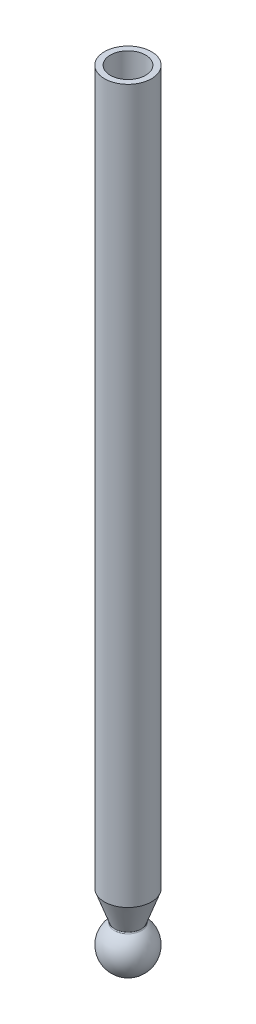
ISO-10303-21;
HEADER;
FILE_DESCRIPTION(('STEP AP214'),'2;1');
FILE_NAME('part.step','',(''),(''),'','','');
FILE_SCHEMA(('AUTOMOTIVE_DESIGN { 1 0 10303 214 1 1 1 1 }'));
ENDSEC;
DATA;
#1=APPLICATION_CONTEXT('core data for automotive mechanical design processes');
#2=APPLICATION_PROTOCOL_DEFINITION('international standard','automotive_design',2000,#1);
#3=PRODUCT_CONTEXT('',#1,'mechanical');
#4=PRODUCT('Part','Part','',(#3));
#5=PRODUCT_RELATED_PRODUCT_CATEGORY('part','',(#4));
#6=PRODUCT_DEFINITION_FORMATION('','',#4);
#7=PRODUCT_DEFINITION_CONTEXT('part definition',#1,'design');
#8=PRODUCT_DEFINITION('design','',#6,#7);
#9=PRODUCT_DEFINITION_SHAPE('','',#8);
#10=(LENGTH_UNIT() NAMED_UNIT(*) SI_UNIT(.MILLI.,.METRE.));
#11=(NAMED_UNIT(*) PLANE_ANGLE_UNIT() SI_UNIT($,.RADIAN.));
#12=(NAMED_UNIT(*) SI_UNIT($,.STERADIAN.) SOLID_ANGLE_UNIT());
#13=UNCERTAINTY_MEASURE_WITH_UNIT(LENGTH_MEASURE(1.E-05),#10,'distance_accuracy_value','');
#14=(GEOMETRIC_REPRESENTATION_CONTEXT(3) GLOBAL_UNCERTAINTY_ASSIGNED_CONTEXT((#13)) GLOBAL_UNIT_ASSIGNED_CONTEXT((#10,
#11,#12)) REPRESENTATION_CONTEXT('',''));
#15=CARTESIAN_POINT('',(0.,0.,0.));
#16=DIRECTION('',(0.,0.,1.));
#17=DIRECTION('',(1.,0.,0.));
#18=AXIS2_PLACEMENT_3D('',#15,#16,#17);
#19=CARTESIAN_POINT('',(0.,-1200.,0.));
#20=DIRECTION('',(0.,1.,0.));
#21=DIRECTION('',(0.,0.,1.));
#22=AXIS2_PLACEMENT_3D('',#19,#20,#21);
#23=CYLINDRICAL_SURFACE('',#22,40.);
#24=CARTESIAN_POINT('',(0.,0.,0.));
#25=DIRECTION('',(0.,1.,0.));
#26=DIRECTION('',(0.,0.,1.));
#27=AXIS2_PLACEMENT_3D('',#24,#25,#26);
#28=CIRCLE('',#27,40.);
#29=CARTESIAN_POINT('',(0.,0.,40.));
#30=VERTEX_POINT('',#29);
#31=EDGE_CURVE('E10',#30,#30,#28,.T.);
#32=ORIENTED_EDGE('',*,*,#31,.F.);
#33=EDGE_LOOP('',(#32));
#34=FACE_BOUND('',#33,.T.);
#35=CARTESIAN_POINT('',(0.,-1214.39999166075,0.));
#36=DIRECTION('',(0.,-1.,0.));
#37=DIRECTION('',(0.745631560094061,0.,-0.666358444526439));
#38=AXIS2_PLACEMENT_3D('',#35,#36,#37);
#39=CIRCLE('',#38,39.9999982021314);
#40=CARTESIAN_POINT('',(-29.8252610632149,-1214.39999166075,26.6543365830327));
#41=VERTEX_POINT('',#40);
#42=EDGE_CURVE('E66',#41,#41,#39,.T.);
#43=ORIENTED_EDGE('',*,*,#42,.F.);
#44=EDGE_LOOP('',(#43));
#45=FACE_BOUND('',#44,.T.);
#46=ADVANCED_FACE('F39',(#34,#45),#23,.T.);
#47=CARTESIAN_POINT('',(0.,0.,0.));
#48=DIRECTION('',(0.,1.,0.));
#49=DIRECTION('',(0.,0.,1.));
#50=AXIS2_PLACEMENT_3D('',#47,#48,#49);
#51=PLANE('',#50);
#52=CARTESIAN_POINT('',(0.,0.,0.));
#53=DIRECTION('',(0.,1.,0.));
#54=DIRECTION('',(0.,0.,1.));
#55=AXIS2_PLACEMENT_3D('',#52,#53,#54);
#56=CIRCLE('',#55,30.);
#57=CARTESIAN_POINT('',(0.,0.,30.));
#58=VERTEX_POINT('',#57);
#59=EDGE_CURVE('E52',#58,#58,#56,.T.);
#60=ORIENTED_EDGE('',*,*,#59,.F.);
#61=EDGE_LOOP('',(#60));
#62=FACE_BOUND('',#61,.T.);
#63=ORIENTED_EDGE('',*,*,#31,.T.);
#64=EDGE_LOOP('',(#63));
#65=FACE_BOUND('',#64,.T.);
#66=ADVANCED_FACE('F74',(#62,#65),#51,.T.);
#67=CARTESIAN_POINT('',(0.,-800.,0.));
#68=DIRECTION('',(0.,1.,0.));
#69=DIRECTION('',(0.,0.,1.));
#70=AXIS2_PLACEMENT_3D('',#67,#68,#69);
#71=CYLINDRICAL_SURFACE('',#70,30.);
#72=CARTESIAN_POINT('',(0.,-800.,0.));
#73=DIRECTION('',(0.,1.,0.));
#74=DIRECTION('',(0.,0.,1.));
#75=AXIS2_PLACEMENT_3D('',#72,#73,#74);
#76=CIRCLE('',#75,30.);
#77=CARTESIAN_POINT('',(0.,-800.,30.));
#78=VERTEX_POINT('',#77);
#79=EDGE_CURVE('E46',#78,#78,#76,.T.);
#80=ORIENTED_EDGE('',*,*,#79,.F.);
#81=EDGE_LOOP('',(#80));
#82=FACE_BOUND('',#81,.T.);
#83=ORIENTED_EDGE('',*,*,#59,.T.);
#84=EDGE_LOOP('',(#83));
#85=FACE_BOUND('',#84,.T.);
#86=ADVANCED_FACE('F79',(#82,#85),#71,.F.);
#87=CARTESIAN_POINT('',(0.,-800.,0.));
#88=DIRECTION('',(0.,1.,0.));
#89=DIRECTION('',(0.,0.,1.));
#90=AXIS2_PLACEMENT_3D('',#87,#88,#89);
#91=PLANE('',#90);
#92=ORIENTED_EDGE('',*,*,#79,.T.);
#93=EDGE_LOOP('',(#92));
#94=FACE_BOUND('',#93,.T.);
#95=ADVANCED_FACE('F84',(#94),#91,.T.);
#96=CARTESIAN_POINT('',(0.,-1297.73332,0.));
#97=DIRECTION('',(0.,-1.,0.));
#98=DIRECTION('',(-0.745631560094061,0.,0.666358444526439));
#99=AXIS2_PLACEMENT_3D('',#96,#97,#98);
#100=SPHERICAL_SURFACE('',#99,40.);
#101=CARTESIAN_POINT('',(0.,-1265.19334513812,0.));
#102=DIRECTION('',(0.,-1.,0.));
#103=DIRECTION('',(0.745631560094061,0.,-0.666358444526439));
#104=AXIS2_PLACEMENT_3D('',#101,#102,#103);
#105=CIRCLE('',#104,23.2626317511265);
#106=CARTESIAN_POINT('',(17.3453524044861,-1265.19334513812,-15.501251109272));
#107=VERTEX_POINT('',#106);
#108=EDGE_CURVE('E63',#107,#107,#105,.T.);
#109=ORIENTED_EDGE('',*,*,#108,.T.);
#110=EDGE_LOOP('',(#109));
#111=FACE_BOUND('',#110,.T.);
#112=ADVANCED_FACE('F91',(#111),#100,.T.);
#113=CARTESIAN_POINT('',(0.,-1264.34078018823,0.));
#114=DIRECTION('',(0.,1.,0.));
#115=DIRECTION('',(-0.745631560094061,0.,0.666358444526439));
#116=AXIS2_PLACEMENT_3D('',#113,#114,#115);
#117=CONICAL_SURFACE('',#116,22.0213143322379,0.345555580581712);
#118=CARTESIAN_POINT('',(0.,-1262.88890745848,0.));
#119=DIRECTION('',(0.,1.,0.));
#120=DIRECTION('',(-0.745631560094061,0.,0.666358444526439));
#121=AXIS2_PLACEMENT_3D('',#118,#119,#120);
#122=CIRCLE('',#121,22.5439885149453);
#123=CARTESIAN_POINT('',(-16.8095093271413,-1262.88890745848,15.0223771202409));
#124=VERTEX_POINT('',#123);
#125=EDGE_CURVE('E59',#124,#124,#122,.T.);
#126=CARTESIAN_POINT('',(-16.8095093271413,-1262.88890745848,15.0223771202409));
#127=CARTESIAN_POINT('',(-16.9450900743921,-1262.38381458559,15.143543364645));
#128=CARTESIAN_POINT('',(-17.0806708216429,-1261.8787217127,15.2647096090491));
#129=CARTESIAN_POINT('',(-17.3518323161444,-1260.86853596691,15.5070420978572));
#130=CARTESIAN_POINT('',(-17.4874130633952,-1260.36344309402,15.6282083422613));
#131=CARTESIAN_POINT('',(-17.7585745578967,-1259.35325734823,15.8705408310695));
#132=CARTESIAN_POINT('',(-17.8941553051475,-1258.84816447534,15.9917070754736));
#133=CARTESIAN_POINT('',(-18.165316799649,-1257.83797872955,16.2340395642817));
#134=CARTESIAN_POINT('',(-18.3008975468998,-1257.33288585666,16.3552058086858));
#135=CARTESIAN_POINT('',(-18.5720590414013,-1256.32270011087,16.597538297494));
#136=CARTESIAN_POINT('',(-18.707639788652,-1255.81760723798,16.718704541898));
#137=CARTESIAN_POINT('',(-18.9788012831536,-1254.80742149219,16.9610370307062));
#138=CARTESIAN_POINT('',(-19.1143820304044,-1254.3023286193,17.0822032751103));
#139=CARTESIAN_POINT('',(-19.3855435249059,-1253.29214287352,17.3245357639185));
#140=CARTESIAN_POINT('',(-19.5211242721567,-1252.78705000062,17.4457020083225));
#141=CARTESIAN_POINT('',(-19.7922857666582,-1251.77686425484,17.6880344971307));
#142=CARTESIAN_POINT('',(-19.927866513909,-1251.27177138194,17.8092007415348));
#143=CARTESIAN_POINT('',(-20.1990280084105,-1250.26158563616,18.0515332303429));
#144=CARTESIAN_POINT('',(-20.3346087556613,-1249.75649276326,18.172699474747));
#145=CARTESIAN_POINT('',(-20.6057702501628,-1248.74630701748,18.4150319635552));
#146=CARTESIAN_POINT('',(-20.7413509974135,-1248.24121414458,18.5361982079592));
#147=CARTESIAN_POINT('',(-21.0125124919151,-1247.2310283988,18.7785306967674));
#148=CARTESIAN_POINT('',(-21.1480932391659,-1246.72593552591,18.8996969411715));
#149=CARTESIAN_POINT('',(-21.4192547336674,-1245.71574978012,19.1420294299797));
#150=CARTESIAN_POINT('',(-21.5548354809182,-1245.21065690723,19.2631956743838));
#151=CARTESIAN_POINT('',(-21.8259969754197,-1244.20047116144,19.5055281631919));
#152=CARTESIAN_POINT('',(-21.9615777226705,-1243.69537828855,19.626694407596));
#153=CARTESIAN_POINT('',(-22.232739217172,-1242.68519254276,19.8690268964042));
#154=CARTESIAN_POINT('',(-22.3683199644228,-1242.18009966987,19.9901931408082));
#155=CARTESIAN_POINT('',(-22.6394814589243,-1241.16991392408,20.2325256296164));
#156=CARTESIAN_POINT('',(-22.7750622061751,-1240.66482105119,20.3536918740205));
#157=CARTESIAN_POINT('',(-23.0462237006766,-1239.6546353054,20.5960243628286));
#158=CARTESIAN_POINT('',(-23.1818044479274,-1239.14954243251,20.7171906072327));
#159=CARTESIAN_POINT('',(-23.4529659424289,-1238.13935668672,20.9595230960409));
#160=CARTESIAN_POINT('',(-23.5885466896797,-1237.63426381383,21.080689340445));
#161=CARTESIAN_POINT('',(-23.8597081841812,-1236.62407806804,21.3230218292531));
#162=CARTESIAN_POINT('',(-23.995288931432,-1236.11898519515,21.4441880736572));
#163=CARTESIAN_POINT('',(-24.2664504259335,-1235.10879944936,21.6865205624654));
#164=CARTESIAN_POINT('',(-24.4020311731843,-1234.60370657647,21.8076868068694));
#165=CARTESIAN_POINT('',(-24.6731926676858,-1233.59352083068,22.0500192956776));
#166=CARTESIAN_POINT('',(-24.8087734149366,-1233.08842795779,22.1711855400817));
#167=CARTESIAN_POINT('',(-25.0799349094381,-1232.078242212,22.4135180288899));
#168=CARTESIAN_POINT('',(-25.2155156566889,-1231.57314933911,22.5346842732939));
#169=CARTESIAN_POINT('',(-25.4866771511904,-1230.56296359333,22.7770167621021));
#170=CARTESIAN_POINT('',(-25.6222578984412,-1230.05787072043,22.8981830065062));
#171=CARTESIAN_POINT('',(-25.8934193929427,-1229.04768497465,23.1405154953144));
#172=CARTESIAN_POINT('',(-26.0290001401935,-1228.54259210175,23.2616817397184));
#173=CARTESIAN_POINT('',(-26.300161634695,-1227.53240635597,23.5040142285266));
#174=CARTESIAN_POINT('',(-26.4357423819458,-1227.02731348307,23.6251804729307));
#175=CARTESIAN_POINT('',(-26.7069038764473,-1226.01712773729,23.8675129617388));
#176=CARTESIAN_POINT('',(-26.8424846236981,-1225.51203486439,23.9886792061429));
#177=CARTESIAN_POINT('',(-27.1136461181996,-1224.50184911861,24.2310116949511));
#178=CARTESIAN_POINT('',(-27.2492268654504,-1223.99675624571,24.3521779393551));
#179=CARTESIAN_POINT('',(-27.5203883599519,-1222.98657049993,24.5945104281633));
#180=CARTESIAN_POINT('',(-27.6559691072027,-1222.48147762704,24.7156766725674));
#181=CARTESIAN_POINT('',(-27.9271306017042,-1221.47129188125,24.9580091613756));
#182=CARTESIAN_POINT('',(-28.062711348955,-1220.96619900836,25.0791754057796));
#183=CARTESIAN_POINT('',(-28.3338728434565,-1219.95601326257,25.3215078945878));
#184=CARTESIAN_POINT('',(-28.4694535907073,-1219.45092038968,25.4426741389919));
#185=CARTESIAN_POINT('',(-28.7406150852088,-1218.44073464389,25.6850066278));
#186=CARTESIAN_POINT('',(-28.8761958324596,-1217.935641771,25.8061728722041));
#187=CARTESIAN_POINT('',(-29.1473573269611,-1216.92545602521,26.0485053610123));
#188=CARTESIAN_POINT('',(-29.2829380742119,-1216.42036315232,26.1696716054164));
#189=CARTESIAN_POINT('',(-29.5540995687134,-1215.41017740653,26.4120040942245));
#190=CARTESIAN_POINT('',(-29.6896803159642,-1214.90508453364,26.5331703386286));
#191=CARTESIAN_POINT('',(-29.8252610632149,-1214.39999166075,26.6543365830327));
#192=B_SPLINE_CURVE_WITH_KNOTS('',3,(#126,#127,#128,#129,#130,#131,#132,#133,#134,#135,#136,
#137,#138,#139,#140,#141,#142,#143,#144,#145,#146,#147,#148,#149,#150,#151,#152,#153,#154,#155,
#156,#157,#158,#159,#160,#161,#162,#163,#164,#165,#166,#167,#168,#169,#170,#171,#172,#173,#174,
#175,#176,#177,#178,#179,#180,#181,#182,#183,#184,#185,#186,#187,#188,#189,#190,#191),
.UNSPECIFIED.,.F.,.F.,(4,2,2,2,2,2,2,2,2,2,2,2,2,2,2,2,2,2,2,2,2,2,2,2,2,2,2,2,2,2,2,2,4),(0.,
1.61047815027055,3.22095630054131,4.83143445081207,6.44191260108283,8.05239075135359,
9.66286890162414,11.2733470518949,12.8838252021657,14.4943033524364,16.1047815027072,
17.7152596529777,19.3257378032485,20.9362159535192,22.54669410379,24.1571722540608,
25.7676504043315,27.3781285546021,28.9886067048728,30.5990848551436,32.2095630054143,
33.8200411556851,35.4305193059557,37.0409974562264,38.6514756064972,40.2619537567679,
41.8724319070387,43.4829100573092,45.09338820758,46.7038663578508,48.3143445081215,
49.9248226583923,51.535300808663),.UNSPECIFIED.);
#193=EDGE_CURVE('BSEAM71',#124,#41,#192,.T.);
#194=ORIENTED_EDGE('',*,*,#125,.T.);
#195=ORIENTED_EDGE('',*,*,#42,.T.);
#196=ORIENTED_EDGE('',*,*,#193,.T.);
#197=ORIENTED_EDGE('',*,*,#193,.F.);
#198=EDGE_LOOP('',(#194,#196,#195,#197));
#199=FACE_BOUND('',#198,.T.);
#200=ADVANCED_FACE('F71',(#199),#117,.T.);
#201=CARTESIAN_POINT('',(0.,-1263.56634639503,0.));
#202=DIRECTION('',(0.,-1.,0.));
#203=DIRECTION('',(0.745631560094061,0.,-0.666358444526439));
#204=AXIS2_PLACEMENT_3D('',#201,#202,#203);
#205=TOROIDAL_SURFACE('',#204,24.4257633386828,2.);
#206=ORIENTED_EDGE('',*,*,#125,.F.);
#207=EDGE_LOOP('',(#206));
#208=FACE_BOUND('',#207,.T.);
#209=ORIENTED_EDGE('',*,*,#108,.F.);
#210=EDGE_LOOP('',(#209));
#211=FACE_BOUND('',#210,.T.);
#212=ADVANCED_FACE('F92',(#208,#211),#205,.F.);
#213=CLOSED_SHELL('',(#46,#66,#86,#95,#112,#200,#212));
#214=MANIFOLD_SOLID_BREP('B2',#213);
#215=ADVANCED_BREP_SHAPE_REPRESENTATION('',(#18,#214),#14);
#216=SHAPE_DEFINITION_REPRESENTATION(#9,#215);
ENDSEC;
END-ISO-10303-21;
